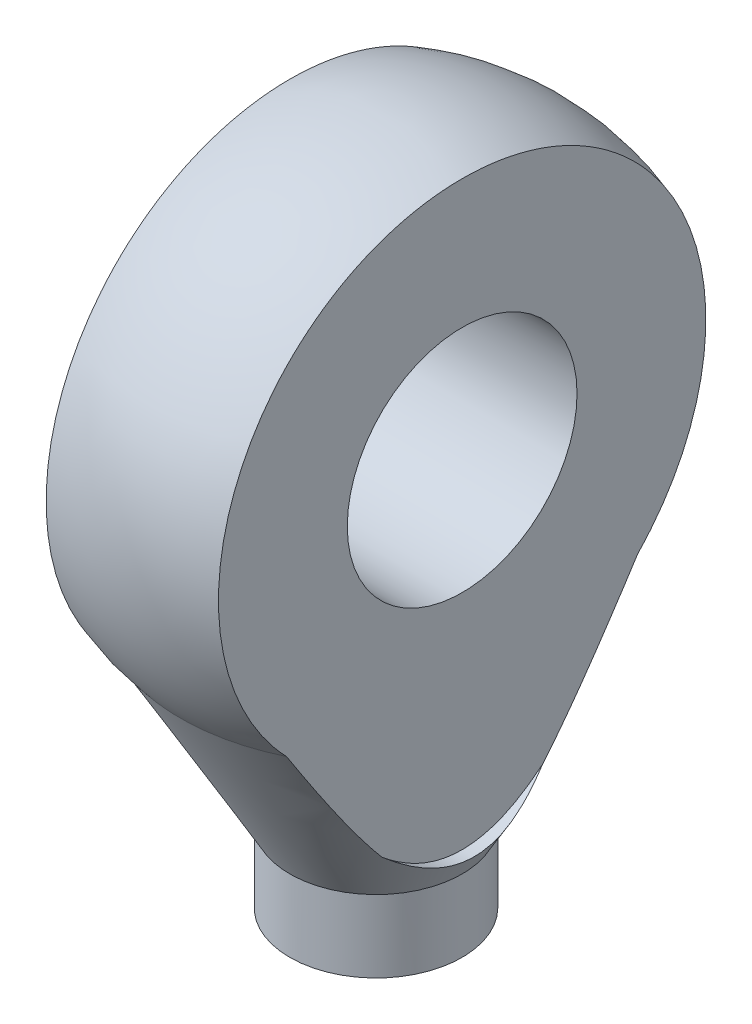
ISO-10303-21;
HEADER;
FILE_DESCRIPTION(('STEP AP214'),'2;1');
FILE_NAME('part.step','',(''),(''),'','','');
FILE_SCHEMA(('AUTOMOTIVE_DESIGN { 1 0 10303 214 1 1 1 1 }'));
ENDSEC;
DATA;
#1=APPLICATION_CONTEXT('core data for automotive mechanical design processes');
#2=APPLICATION_PROTOCOL_DEFINITION('international standard','automotive_design',2000,#1);
#3=PRODUCT_CONTEXT('',#1,'mechanical');
#4=PRODUCT('Part','Part','',(#3));
#5=PRODUCT_RELATED_PRODUCT_CATEGORY('part','',(#4));
#6=PRODUCT_DEFINITION_FORMATION('','',#4);
#7=PRODUCT_DEFINITION_CONTEXT('part definition',#1,'design');
#8=PRODUCT_DEFINITION('design','',#6,#7);
#9=PRODUCT_DEFINITION_SHAPE('','',#8);
#10=(LENGTH_UNIT() NAMED_UNIT(*) SI_UNIT(.MILLI.,.METRE.));
#11=(NAMED_UNIT(*) PLANE_ANGLE_UNIT() SI_UNIT($,.RADIAN.));
#12=(NAMED_UNIT(*) SI_UNIT($,.STERADIAN.) SOLID_ANGLE_UNIT());
#13=UNCERTAINTY_MEASURE_WITH_UNIT(LENGTH_MEASURE(1.E-05),#10,'distance_accuracy_value','');
#14=(GEOMETRIC_REPRESENTATION_CONTEXT(3) GLOBAL_UNCERTAINTY_ASSIGNED_CONTEXT((#13)) GLOBAL_UNIT_ASSIGNED_CONTEXT((#10,
#11,#12)) REPRESENTATION_CONTEXT('',''));
#15=CARTESIAN_POINT('',(0.,0.,0.));
#16=DIRECTION('',(0.,0.,1.));
#17=DIRECTION('',(1.,0.,0.));
#18=AXIS2_PLACEMENT_3D('',#15,#16,#17);
#19=CARTESIAN_POINT('',(0.,85.,0.));
#20=DIRECTION('',(0.,1.,0.));
#21=DIRECTION('',(1.,0.,0.));
#22=AXIS2_PLACEMENT_3D('',#19,#20,#21);
#23=SPHERICAL_SURFACE('',#22,9.00000000000001);
#24=CARTESIAN_POINT('',(3.,85.,0.));
#25=DIRECTION('',(-1.,0.,0.));
#26=DIRECTION('',(0.,0.,1.));
#27=AXIS2_PLACEMENT_3D('',#24,#25,#26);
#28=CIRCLE('',#27,8.48528137423857);
#29=CARTESIAN_POINT('',(3.,79.1171774114558,-6.11493241105034));
#30=VERTEX_POINT('',#29);
#31=CARTESIAN_POINT('',(3.,79.1171774114558,6.11493241105033));
#32=VERTEX_POINT('',#31);
#33=EDGE_CURVE('E81',#30,#32,#28,.F.);
#34=ORIENTED_EDGE('',*,*,#33,.F.);
#35=CARTESIAN_POINT('',(0.,79.1171774114558,0.));
#36=DIRECTION('',(0.,1.,0.));
#37=DIRECTION('',(-1.,0.,0.));
#38=AXIS2_PLACEMENT_3D('',#35,#36,#37);
#39=CIRCLE('',#38,6.81119654625484);
#40=CARTESIAN_POINT('',(-3.,79.1171774114558,-6.11493241105033));
#41=VERTEX_POINT('',#40);
#42=EDGE_CURVE('E98',#30,#41,#39,.T.);
#43=ORIENTED_EDGE('',*,*,#42,.T.);
#44=CARTESIAN_POINT('',(-3.,85.,0.));
#45=DIRECTION('',(1.,0.,0.));
#46=DIRECTION('',(0.,0.,-1.));
#47=AXIS2_PLACEMENT_3D('',#44,#45,#46);
#48=CIRCLE('',#47,8.48528137423857);
#49=CARTESIAN_POINT('',(-3.,79.1171774114558,6.11493241105034));
#50=VERTEX_POINT('',#49);
#51=EDGE_CURVE('E190',#50,#41,#48,.F.);
#52=ORIENTED_EDGE('',*,*,#51,.F.);
#53=EDGE_CURVE('E205',#50,#32,#39,.T.);
#54=ORIENTED_EDGE('',*,*,#53,.T.);
#55=EDGE_LOOP('',(#34,#43,#52,#54));
#56=FACE_BOUND('',#55,.T.);
#57=ADVANCED_FACE('F35',(#56),#23,.T.);
#58=CARTESIAN_POINT('',(0.,79.1171774114558,0.));
#59=DIRECTION('',(0.,1.,0.));
#60=DIRECTION('',(-1.,0.,0.));
#61=AXIS2_PLACEMENT_3D('',#58,#59,#60);
#62=CONICAL_SURFACE('',#61,6.81119654625484,0.5235987755983);
#63=CARTESIAN_POINT('',(3.,89.0277129654258,12.1687002182849));
#64=CARTESIAN_POINT('',(3.,88.434232047291,11.8157499478818));
#65=CARTESIAN_POINT('',(3.,87.8410989137341,11.4622109965145));
#66=CARTESIAN_POINT('',(3.,86.6557732662857,10.7533686630437));
#67=CARTESIAN_POINT('',(3.,86.0635808988087,10.3980650361904));
#68=CARTESIAN_POINT('',(3.,84.8778019608484,9.68354997630685));
#69=CARTESIAN_POINT('',(3.,84.2842217051544,9.32432805553628));
#70=CARTESIAN_POINT('',(3.,83.0990532287702,8.6027757178759));
#71=CARTESIAN_POINT('',(3.,82.5074647634746,8.24044570362898));
#72=CARTESIAN_POINT('',(3.,81.6184937554911,7.6912142996937));
#73=CARTESIAN_POINT('',(3.,81.3200572632117,7.50601921420721));
#74=CARTESIAN_POINT('',(3.,80.724096123733,7.13416838224396));
#75=CARTESIAN_POINT('',(3.,80.4265714737866,6.94751264017397));
#76=CARTESIAN_POINT('',(3.,79.832554106558,6.57230122932179));
#77=CARTESIAN_POINT('',(3.,79.5360618518418,6.38374482741821));
#78=CARTESIAN_POINT('',(3.,78.9445772011473,6.00430627463596));
#79=CARTESIAN_POINT('',(3.,78.6495847698979,5.81342417881238));
#80=CARTESIAN_POINT('',(3.,78.0622598733851,5.42906288453661));
#81=CARTESIAN_POINT('',(3.,77.7699228516894,5.23559066657521));
#82=CARTESIAN_POINT('',(3.,77.1879807413533,4.84459280960352));
#83=CARTESIAN_POINT('',(3.,76.8983755648414,4.64706730162326));
#84=CARTESIAN_POINT('',(3.,76.3232223103403,4.24652122906868));
#85=CARTESIAN_POINT('',(3.,76.0376718528191,4.0435041092881));
#86=CARTESIAN_POINT('',(3.,75.6138620000634,3.73286576400031));
#87=CARTESIAN_POINT('',(3.,75.4733566777263,3.62831020391827));
#88=CARTESIAN_POINT('',(3.,75.194269065799,3.41666704144714));
#89=CARTESIAN_POINT('',(3.,75.055686666919,3.30957958390227));
#90=CARTESIAN_POINT('',(3.,74.8707902866183,3.16327040881839));
#91=CARTESIAN_POINT('',(3.,74.8233732024426,3.12544036331517));
#92=CARTESIAN_POINT('',(3.,74.728871584163,3.04936468537097));
#93=CARTESIAN_POINT('',(3.,74.6817870587351,3.01111904215343));
#94=CARTESIAN_POINT('',(3.,74.5410781480917,2.89570208608246));
#95=CARTESIAN_POINT('',(3.,74.4480048630145,2.81785582178319));
#96=CARTESIAN_POINT('',(3.,74.2633610961785,2.65974724133996));
#97=CARTESIAN_POINT('',(3.,74.1717970408566,2.57947739965823));
#98=CARTESIAN_POINT('',(3.,73.9910056101773,2.41635099384583));
#99=CARTESIAN_POINT('',(3.,73.9017780660762,2.33349461746842));
#100=CARTESIAN_POINT('',(3.,73.7213588471127,2.15984324306072));
#101=CARTESIAN_POINT('',(3.,73.6303428755116,2.06886453738327));
#102=CARTESIAN_POINT('',(3.,73.4528003877012,1.88249940937518));
#103=CARTESIAN_POINT('',(3.,73.3662762045741,1.78711074414376));
#104=CARTESIAN_POINT('',(3.,73.1998721089525,1.59128618413));
#105=CARTESIAN_POINT('',(3.,73.1199675670819,1.4908714561862));
#106=CARTESIAN_POINT('',(3.,72.969234718366,1.28351192700059));
#107=CARTESIAN_POINT('',(3.,72.8983942844151,1.17657613957359));
#108=CARTESIAN_POINT('',(3.,72.7765609553431,0.96645130754558));
#109=CARTESIAN_POINT('',(3.,72.7242703443368,0.864028431115825));
#110=CARTESIAN_POINT('',(3.,72.6346279566756,0.652732100806545));
#111=CARTESIAN_POINT('',(3.,72.5972532607749,0.543868840871355));
#112=CARTESIAN_POINT('',(3.,72.5557730490834,0.376134130535145));
#113=CARTESIAN_POINT('',(3.,72.5443475838237,0.319041613266724));
#114=CARTESIAN_POINT('',(3.,72.5270521986943,0.20403332399558));
#115=CARTESIAN_POINT('',(3.,72.5211792974264,0.146118010762202));
#116=CARTESIAN_POINT('',(3.,72.5152790137246,0.0299914911495968));
#117=CARTESIAN_POINT('',(3.,72.5152510938561,-0.0282196875331749));
#118=CARTESIAN_POINT('',(3.,72.5210284954344,-0.144336961479267));
#119=CARTESIAN_POINT('',(3.,72.5268336550078,-0.202243065163875));
#120=CARTESIAN_POINT('',(3.,72.5502174372495,-0.358638552878509));
#121=CARTESIAN_POINT('',(3.,72.5732628430674,-0.456338339745938));
#122=CARTESIAN_POINT('',(3.,72.6330636261563,-0.647301530251787));
#123=CARTESIAN_POINT('',(3.,72.6698244690738,-0.740563148536991));
#124=CARTESIAN_POINT('',(3.,72.7515804328953,-0.917317207215446));
#125=CARTESIAN_POINT('',(3.,72.7960348012717,-1.00106543109796));
#126=CARTESIAN_POINT('',(3.,72.8920743192687,-1.16440859380664));
#127=CARTESIAN_POINT('',(3.,72.9436660803192,-1.24399958648427));
#128=CARTESIAN_POINT('',(3.,73.0524549384102,-1.39978566722155));
#129=CARTESIAN_POINT('',(3.,73.1096780294507,-1.47596239525543));
#130=CARTESIAN_POINT('',(3.,73.2281964991644,-1.62499472393054));
#131=CARTESIAN_POINT('',(3.,73.2894900167229,-1.69785181705784));
#132=CARTESIAN_POINT('',(3.,73.4128121056983,-1.8380083385662));
#133=CARTESIAN_POINT('',(3.,73.4747210064176,-1.90541373898393));
#134=CARTESIAN_POINT('',(3.,73.6008680013315,-2.03801479987932));
#135=CARTESIAN_POINT('',(3.,73.6651064074381,-2.10321016216308));
#136=CARTESIAN_POINT('',(3.,73.8606866164158,-2.29604275359615));
#137=CARTESIAN_POINT('',(3.,73.9948207335177,-2.4208460327615));
#138=CARTESIAN_POINT('',(3.,74.2683832762052,-2.66509747567564));
#139=CARTESIAN_POINT('',(3.,74.4078234904095,-2.78453225378121));
#140=CARTESIAN_POINT('',(3.,74.6902925209801,-3.01909976029142));
#141=CARTESIAN_POINT('',(3.,74.8333217908261,-3.13423194043842));
#142=CARTESIAN_POINT('',(3.,75.1232017985246,-3.36206864070738));
#143=CARTESIAN_POINT('',(3.,75.2700743246175,-3.47474530811474));
#144=CARTESIAN_POINT('',(3.,75.5658644386073,-3.69739679538848));
#145=CARTESIAN_POINT('',(3.,75.714782175558,-3.80737141668458));
#146=CARTESIAN_POINT('',(3.,76.0139566069063,-4.02495482493012));
#147=CARTESIAN_POINT('',(3.,76.1642106831252,-4.13256721989674));
#148=CARTESIAN_POINT('',(3.,76.4659757828991,-4.34600183579522));
#149=CARTESIAN_POINT('',(3.,76.6174867680731,-4.45182411109229));
#150=CARTESIAN_POINT('',(3.,77.0237486446238,-4.73265188833168));
#151=CARTESIAN_POINT('',(3.,77.2794159168286,-4.90633111554099));
#152=CARTESIAN_POINT('',(3.,77.792825862969,-5.25059867156008));
#153=CARTESIAN_POINT('',(3.,78.0505685936372,-5.42118691546077));
#154=CARTESIAN_POINT('',(3.,78.5676436732109,-5.75998735813301));
#155=CARTESIAN_POINT('',(3.,78.8269761691556,-5.92819933221717));
#156=CARTESIAN_POINT('',(3.,79.3468582066832,-6.26273339980386));
#157=CARTESIAN_POINT('',(3.,79.6074077573884,-6.42905547910873));
#158=CARTESIAN_POINT('',(3.,80.3910555904301,-6.92612513901494));
#159=CARTESIAN_POINT('',(3.,80.915589052725,-7.25460920510286));
#160=CARTESIAN_POINT('',(3.,81.9671332766999,-7.90750982691125));
#161=CARTESIAN_POINT('',(3.,82.4941439018356,-8.23192660329325));
#162=CARTESIAN_POINT('',(3.,83.5206707500642,-8.85997517248174));
#163=CARTESIAN_POINT('',(3.,84.0200919504452,-9.16376240686829));
#164=CARTESIAN_POINT('',(3.,85.0201076780668,-9.76941744177943));
#165=CARTESIAN_POINT('',(3.,85.5207022255603,-10.0712852088334));
#166=CARTESIAN_POINT('',(3.,86.5219807556379,-10.6730697781602));
#167=CARTESIAN_POINT('',(3.,87.0226633350382,-10.9729889166163));
#168=CARTESIAN_POINT('',(3.,88.0247156266938,-11.5716505637289));
#169=CARTESIAN_POINT('',(3.,88.5260853225151,-11.8703930998868));
#170=CARTESIAN_POINT('',(3.,89.0277129654258,-12.1687002182849));
#171=B_SPLINE_CURVE_WITH_KNOTS('',3,(#63,#64,#65,#66,#67,#68,#69,#70,#71,#72,#73,#74,#75,#76,
#77,#78,#79,#80,#81,#82,#83,#84,#85,#86,#87,#88,#89,#90,#91,#92,#93,#94,#95,#96,#97,#98,#99,
#100,#101,#102,#103,#104,#105,#106,#107,#108,#109,#110,#111,#112,#113,#114,#115,#116,#117,#118,
#119,#120,#121,#122,#123,#124,#125,#126,#127,#128,#129,#130,#131,#132,#133,#134,#135,#136,#137,
#138,#139,#140,#141,#142,#143,#144,#145,#146,#147,#148,#149,#150,#151,#152,#153,#154,#155,#156,
#157,#158,#159,#160,#161,#162,#163,#164,#165,#166,#167,#168,#169,#170),.UNSPECIFIED.,.F.,.F.,(4,
2,2,2,2,2,2,2,2,2,2,2,2,2,2,2,2,2,2,2,2,2,2,2,2,2,2,2,2,2,2,2,2,2,2,2,2,2,2,2,2,2,2,2,2,2,2,2,2,
2,2,2,2,4),(0.,2.07150978561835,4.14331538084288,6.22475142290165,8.30592177616018,
9.35960450625664,10.4132840586332,11.4673868982472,12.5214648328515,13.5731191803624,
14.6247395846099,15.6757149606134,16.2011115258245,16.7264781066457,16.9084526211638,
17.0904318656441,17.4544149359308,17.8196764181035,18.1849114477832,18.5708648295217,
18.9570167139181,19.3416604870048,19.7257841308175,20.0699752859968,20.4136355144558,
20.5880764974506,20.7624237626793,20.9367549970078,21.1110813936162,21.4108862712883,
21.7108107500145,21.9948126704685,22.2790794481796,22.5647261274918,22.8502430884742,
23.1247405190994,23.3992748406134,23.9486681764226,24.4993629288385,25.0501276157971,
25.6054346266943,26.1607823251405,26.7152126471424,27.2696261009816,28.1968311261058,
29.1240615829958,30.0513791347979,30.9787036483856,32.8353711110109,34.6919374046468,
36.4456059209534,38.1993049333743,39.9502203360893,41.7010945677724),.UNSPECIFIED.);
#172=CARTESIAN_POINT('',(3.00000000000001,74.4196522180206,2.79312647703188));
#173=VERTEX_POINT('',#172);
#174=EDGE_CURVE('E77',#32,#173,#171,.T.);
#175=ORIENTED_EDGE('',*,*,#174,.F.);
#176=ORIENTED_EDGE('',*,*,#53,.F.);
#177=CARTESIAN_POINT('',(-3.,89.0277560384104,-12.1687258310688));
#178=CARTESIAN_POINT('',(-3.,88.4342737998858,-11.8157748181514));
#179=CARTESIAN_POINT('',(-3.,87.8411393452726,-11.4622351253413));
#180=CARTESIAN_POINT('',(-3.,86.655811054519,-10.753391312506));
#181=CARTESIAN_POINT('',(-3.,86.0636173647911,-10.3980869477342));
#182=CARTESIAN_POINT('',(-3.,84.8778358026119,-9.68357043006131));
#183=CARTESIAN_POINT('',(-3.,84.2842542448709,-9.32434778954934));
#184=CARTESIAN_POINT('',(-3.,83.0990831597275,-8.60279401778763));
#185=CARTESIAN_POINT('',(-3.,82.5074933877232,-8.24046328917527));
#186=CARTESIAN_POINT('',(-3.,81.6185205178066,-7.69123088403873));
#187=CARTESIAN_POINT('',(-3.,81.3200834722554,-7.50603550901599));
#188=CARTESIAN_POINT('',(-3.,80.7241212235236,-7.13418410185813));
#189=CARTESIAN_POINT('',(-3.,80.4265960175958,-6.94752807412972));
#190=CARTESIAN_POINT('',(-3.,79.8325775360229,-6.57231609776945));
#191=CARTESIAN_POINT('',(-3.,79.5360847229366,-6.38375941602701));
#192=CARTESIAN_POINT('',(-3.,78.9445989504849,-6.00432031021664));
#193=CARTESIAN_POINT('',(-3.,78.6496059558487,-5.81343794120294));
#194=CARTESIAN_POINT('',(-3.,78.0622799194358,-5.42907610548068));
#195=CARTESIAN_POINT('',(-3.,77.7699423212926,-5.23560361916535));
#196=CARTESIAN_POINT('',(-3.,77.1879990476705,-4.84460523814611));
#197=CARTESIAN_POINT('',(-3.,76.8983932843215,-4.64707947447032));
#198=CARTESIAN_POINT('',(-3.,76.3232388383661,-4.2465329080166));
#199=CARTESIAN_POINT('',(-3.,76.0376877762661,-4.04351554997992));
#200=CARTESIAN_POINT('',(-3.,75.6138769952852,-3.7328768691377));
#201=CARTESIAN_POINT('',(-3.,75.4733713598575,-3.62832120073357));
#202=CARTESIAN_POINT('',(-3.,75.1942831120112,-3.41667783112717));
#203=CARTESIAN_POINT('',(-3.,75.0557003903047,-3.30959027476666));
#204=CARTESIAN_POINT('',(-3.,74.8708034000829,-3.16328084360759));
#205=CARTESIAN_POINT('',(-3.,74.8233860359099,-3.12545063406779));
#206=CARTESIAN_POINT('',(-3.,74.7288838582008,-3.04937462670332));
#207=CARTESIAN_POINT('',(-3.,74.6817990533405,-3.01112881810216));
#208=CARTESIAN_POINT('',(-3.,74.5410893053854,-2.89571136349466));
#209=CARTESIAN_POINT('',(-3.,74.4480154634578,-2.81786476368348));
#210=CARTESIAN_POINT('',(-3.,74.2633705836618,-2.65975550105092));
#211=CARTESIAN_POINT('',(-3.,74.1718059722762,-2.57948531262512));
#212=CARTESIAN_POINT('',(-3.,73.9910134364226,-2.41635820121366));
#213=CARTESIAN_POINT('',(-3.,73.9017853432073,-2.33350146598541));
#214=CARTESIAN_POINT('',(-3.,73.7213651323804,-2.15984945726707));
#215=CARTESIAN_POINT('',(-3.,73.6303487140913,-2.06887047991192));
#216=CARTESIAN_POINT('',(-3.,73.452805338906,-1.88250479307693));
#217=CARTESIAN_POINT('',(-3.,73.3662807151093,-1.7871158406752));
#218=CARTESIAN_POINT('',(-3.,73.1998757548834,-1.59129068561688));
#219=CARTESIAN_POINT('',(-3.,73.1199707889243,-1.4908756499763));
#220=CARTESIAN_POINT('',(-3.,72.9692371206303,-1.28351546985734));
#221=CARTESIAN_POINT('',(-3.,72.8983962910955,-1.17657933928567));
#222=CARTESIAN_POINT('',(-3.,72.7765624470179,-0.966454114268257));
#223=CARTESIAN_POINT('',(-3.,72.724271677941,-0.864031212549511));
#224=CARTESIAN_POINT('',(-3.,72.6346289563856,-0.652734816013351));
#225=CARTESIAN_POINT('',(-3.,72.5972540848555,-0.543871515088102));
#226=CARTESIAN_POINT('',(-3.,72.5557736059994,-0.376136717993239));
#227=CARTESIAN_POINT('',(-3.,72.5443480502825,-0.319044165681971));
#228=CARTESIAN_POINT('',(-3.,72.5270524883237,-0.204035797797916));
#229=CARTESIAN_POINT('',(-3.,72.5211795006703,-0.146120441000833));
#230=CARTESIAN_POINT('',(-3.,72.5152790526683,-0.0299938267689614));
#231=CARTESIAN_POINT('',(-3.,72.5152510547743,0.02821740296291));
#232=CARTESIAN_POINT('',(-3.,72.521028312437,0.144334785874696));
#233=CARTESIAN_POINT('',(-3.,72.5268334061123,0.202240947476107));
#234=CARTESIAN_POINT('',(-3.,72.5502170213224,0.358636545981177));
#235=CARTESIAN_POINT('',(-3.,72.5732623316436,0.456336391435761));
#236=CARTESIAN_POINT('',(-3.,72.6330629549837,0.647299704354069));
#237=CARTESIAN_POINT('',(-3.,72.6698237337813,0.740561386427215));
#238=CARTESIAN_POINT('',(-3.,72.7515795130524,0.917315381865707));
#239=CARTESIAN_POINT('',(-3.,72.7960337395705,1.00106348840098));
#240=CARTESIAN_POINT('',(-3.,72.8920729653838,1.16440642832545));
#241=CARTESIAN_POINT('',(-3.,72.9436645760816,1.24399731558933));
#242=CARTESIAN_POINT('',(-3.,73.0524531283529,1.39978319256828));
#243=CARTESIAN_POINT('',(-3.,73.1096760638538,1.47595982233618));
#244=CARTESIAN_POINT('',(-3.,73.2281942210339,1.62499196043371));
#245=CARTESIAN_POINT('',(-3.,73.2894875816058,1.69784896124146));
#246=CARTESIAN_POINT('',(-3.,73.4128092572761,1.83800518616389));
#247=CARTESIAN_POINT('',(-3.,73.4747178966216,1.90541038666289));
#248=CARTESIAN_POINT('',(-3.,73.6008643616808,2.03801105722609));
#249=CARTESIAN_POINT('',(-3.,73.6651024993045,2.10320622909875));
#250=CARTESIAN_POINT('',(-3.,73.8606818952851,2.29603825970857));
#251=CARTESIAN_POINT('',(-3.,73.9948154607641,2.4208411792539));
#252=CARTESIAN_POINT('',(-3.,74.2683768896979,2.66509191876891));
#253=CARTESIAN_POINT('',(-3.,74.4078165417401,2.78452635314735));
#254=CARTESIAN_POINT('',(-3.,74.6902844432444,3.01909318262033));
#255=CARTESIAN_POINT('',(-3.,74.8333131461861,3.13422502945808));
#256=CARTESIAN_POINT('',(-3.,75.1231920188387,3.36206107151324));
#257=CARTESIAN_POINT('',(-3.,75.2700639768778,3.47473741393267));
#258=CARTESIAN_POINT('',(-3.,75.5658529535919,3.69738825518873));
#259=CARTESIAN_POINT('',(-3.,75.7147701213204,3.80736255545595));
#260=CARTESIAN_POINT('',(-3.,76.0139434147841,4.02494532478665));
#261=CARTESIAN_POINT('',(-3.,76.1641969223425,4.13255740186175));
#262=CARTESIAN_POINT('',(-3.,76.46596088471,4.34599138351962));
#263=CARTESIAN_POINT('',(-3.,76.6174713011383,4.4518133424677));
#264=CARTESIAN_POINT('',(-3.,77.0237338558989,4.73264179525332));
#265=CARTESIAN_POINT('',(-3.,77.2794023997137,4.90632197966632));
#266=CARTESIAN_POINT('',(-3.,77.792814919977,5.25059140540468));
#267=CARTESIAN_POINT('',(-3.,78.0505589531604,5.42118056181743));
#268=CARTESIAN_POINT('',(-3.,78.5676366588953,5.75998279914889));
#269=CARTESIAN_POINT('',(-3.,78.8269704784909,5.92819565537243));
#270=CARTESIAN_POINT('',(-3.,79.346855177442,6.26273146549366));
#271=CARTESIAN_POINT('',(-3.,79.60740606592,6.42905440519328));
#272=CARTESIAN_POINT('',(-3.,80.3910579341883,6.92612662771382));
#273=CARTESIAN_POINT('',(-3.,80.9155941086884,7.25461237274563));
#274=CARTESIAN_POINT('',(-3.,81.9671437768233,7.90751631823577));
#275=CARTESIAN_POINT('',(-3.,82.4941571339095,8.23193473936259));
#276=CARTESIAN_POINT('',(-3.,83.5206889739402,8.85998628405355));
#277=CARTESIAN_POINT('',(-3.,84.0201124324764,9.16377485199276));
#278=CARTESIAN_POINT('',(-3.,85.0201326819595,9.76943254510737));
#279=CARTESIAN_POINT('',(-3.,85.5207294931601,10.0713016368112));
#280=CARTESIAN_POINT('',(-3.,86.5220125428199,10.6730888429893));
#281=CARTESIAN_POINT('',(-3.,87.0226973780765,10.9730092936783));
#282=CARTESIAN_POINT('',(-3.,88.0247541834247,11.5716735611994));
#283=CARTESIAN_POINT('',(-3.,88.5261261370819,11.8704174055336));
#284=CARTESIAN_POINT('',(-3.,89.0277560384104,12.1687258310689));
#285=B_SPLINE_CURVE_WITH_KNOTS('',3,(#177,#178,#179,#180,#181,#182,#183,#184,#185,#186,#187,
#188,#189,#190,#191,#192,#193,#194,#195,#196,#197,#198,#199,#200,#201,#202,#203,#204,#205,#206,
#207,#208,#209,#210,#211,#212,#213,#214,#215,#216,#217,#218,#219,#220,#221,#222,#223,#224,#225,
#226,#227,#228,#229,#230,#231,#232,#233,#234,#235,#236,#237,#238,#239,#240,#241,#242,#243,#244,
#245,#246,#247,#248,#249,#250,#251,#252,#253,#254,#255,#256,#257,#258,#259,#260,#261,#262,#263,
#264,#265,#266,#267,#268,#269,#270,#271,#272,#273,#274,#275,#276,#277,#278,#279,#280,#281,#282,
#283,#284),.UNSPECIFIED.,.F.,.F.,(4,2,2,2,2,2,2,2,2,2,2,2,2,2,2,2,2,2,2,2,2,2,2,2,2,2,2,2,2,2,2,
2,2,2,2,2,2,2,2,2,2,2,2,2,2,2,2,2,2,2,2,2,2,4),(0.,2.07151432880308,4.14332446447923,
6.22476496634114,8.30593978197319,9.3596243804242,10.4133058011789,11.4674105048543,
12.5214903038017,13.5731465379631,14.6247688291898,15.6757460986872,16.2011436116266,
16.7265111405182,16.9084866185632,17.0904668265472,17.4544518239936,17.8197152462449,
18.1849522154005,18.5709071211108,18.9570605314459,19.3417058183644,19.7258309715161,
20.0700224124117,20.4136829300308,20.5881240692064,20.7624714901832,20.9368028769624,
21.1111294257867,21.4109344048782,21.7108589876837,21.9948603988576,22.2791266660227,
22.5647728294617,22.8502892752676,23.1247857340851,23.3993190835272,23.9487104734615,
24.4994032742436,25.0501660093834,25.6054710746906,26.1608168272872,26.7152452070026,
27.2696567185681,28.1968665119561,29.1241017379228,30.0514240611478,30.9787533463204,
32.8354303778074,34.6920062374273,36.445682620598,38.1993895007151,39.9503127320578,
41.701194791452),.UNSPECIFIED.);
#286=CARTESIAN_POINT('',(-3.,74.41965468106,2.7931244832241));
#287=VERTEX_POINT('',#286);
#288=EDGE_CURVE('E188',#287,#50,#285,.T.);
#289=ORIENTED_EDGE('',*,*,#288,.F.);
#290=CARTESIAN_POINT('',(-3.,74.4192790096168,-2.79297030664519));
#291=CARTESIAN_POINT('',(-3.02439317343294,74.3481356839449,-2.70645602250348));
#292=CARTESIAN_POINT('',(-3.04837521829061,74.2786419297085,-2.61841294404528));
#293=CARTESIAN_POINT('',(-3.09540712839202,74.1432187857204,-2.43827843601746));
#294=CARTESIAN_POINT('',(-3.11844834877223,74.0773211227418,-2.34616096090742));
#295=CARTESIAN_POINT('',(-3.16316240566757,73.950309684511,-2.15796244216625));
#296=CARTESIAN_POINT('',(-3.18483138568511,73.8892092851151,-2.06187138262416));
#297=CARTESIAN_POINT('',(-3.22669834518542,73.7720600627313,-1.864055779825));
#298=CARTESIAN_POINT('',(-3.24686550944076,73.7161133078009,-1.76226372947803));
#299=CARTESIAN_POINT('',(-3.2848572802394,73.6119858337272,-1.55465386494234));
#300=CARTESIAN_POINT('',(-3.30268760809237,73.5637860793503,-1.44884673307941));
#301=CARTESIAN_POINT('',(-3.33534232282723,73.4763814945651,-1.23330545893348));
#302=CARTESIAN_POINT('',(-3.35017195009896,73.4371609669068,-1.12357856348245));
#303=CARTESIAN_POINT('',(-3.3731922017148,73.3765620293768,-0.925676968354581));
#304=CARTESIAN_POINT('',(-3.38212585052579,73.3531546750219,-0.838208994648996));
#305=CARTESIAN_POINT('',(-3.39750181093112,73.3130532027933,-0.661498803030849));
#306=CARTESIAN_POINT('',(-3.4039437032509,73.2963602146913,-0.572256289179761));
#307=CARTESIAN_POINT('',(-3.414045953537,73.2702311437185,-0.393200045162188));
#308=CARTESIAN_POINT('',(-3.41772566541122,73.260744561636,-0.303394821399612));
#309=CARTESIAN_POINT('',(-3.42222898278666,73.2491054350199,-0.123238371545295));
#310=CARTESIAN_POINT('',(-3.42305278418696,73.246952387448,-0.0328871833294897));
#311=CARTESIAN_POINT('',(-3.42186345562618,73.2501427304463,0.147936669518136));
#312=CARTESIAN_POINT('',(-3.41984165463753,73.2555090335173,0.238408862538559));
#313=CARTESIAN_POINT('',(-3.4129043639022,73.2734052411548,0.418525411046793));
#314=CARTESIAN_POINT('',(-3.40798880007721,73.285935329109,0.508169745282322));
#315=CARTESIAN_POINT('',(-3.39554504728233,73.3180332134235,0.686266415703885));
#316=CARTESIAN_POINT('',(-3.38800930633628,73.3376213587806,0.77471453011728));
#317=CARTESIAN_POINT('',(-3.37057228207245,73.3832781954814,0.949683163735511));
#318=CARTESIAN_POINT('',(-3.3606707629047,73.4093475329609,1.03620348981385));
#319=CARTESIAN_POINT('',(-3.34206289647822,73.4588075112634,1.18172302180349));
#320=CARTESIAN_POINT('',(-3.33386787770376,73.4807136028982,1.2413002560983));
#321=CARTESIAN_POINT('',(-3.31654127175499,73.5271812190986,1.35927436664292));
#322=CARTESIAN_POINT('',(-3.3074095897971,73.5517430124158,1.41767112271962));
#323=CARTESIAN_POINT('',(-3.27880442822619,73.6291577161089,1.59105323731189));
#324=CARTESIAN_POINT('',(-3.25812546574755,73.6857277664231,1.70419523584031));
#325=CARTESIAN_POINT('',(-3.21427394308556,73.807071601242,1.92562891948502));
#326=CARTESIAN_POINT('',(-3.19109779744476,73.8718572058907,2.03391330563449));
#327=CARTESIAN_POINT('',(-3.14283969185625,74.0080137862491,2.24574484538296));
#328=CARTESIAN_POINT('',(-3.11775830858496,74.0793827706952,2.34929341733315));
#329=CARTESIAN_POINT('',(-3.07704349660686,74.1962215166165,2.5092612578287));
#330=CARTESIAN_POINT('',(-3.06189099722535,74.2399070534755,2.56712403112803));
#331=CARTESIAN_POINT('',(-3.03121995651073,74.3286876147634,2.6812636683635));
#332=CARTESIAN_POINT('',(-3.01570316709403,74.373776138808,2.73754605375918));
#333=CARTESIAN_POINT('',(-3.00000000000002,74.4195563231677,2.7932052687538));
#334=B_SPLINE_CURVE_WITH_KNOTS('',3,(#290,#291,#292,#293,#294,#295,#296,#297,#298,#299,#300,
#301,#302,#303,#304,#305,#306,#307,#308,#309,#310,#311,#312,#313,#314,#315,#316,#317,#318,#319,
#320,#321,#322,#323,#324,#325,#326,#327,#328,#329,#330,#331,#332,#333),.UNSPECIFIED.,.F.,.F.,(4,
2,2,2,2,2,2,2,2,2,2,2,2,2,2,2,2,2,2,2,2,4),(0.,0.343945524371458,0.690551362610508,
1.03809161803248,1.39146842644718,1.74396321779484,2.09583699971362,2.36852595572555,
2.64126077571104,2.91206630042888,3.182853249073,3.45446711966604,3.72608794368832,
3.99849822381784,4.27093567250558,4.46287378464556,4.65483133874166,5.03885863538797,
5.42344485756082,5.80791513366597,6.03009392354696,6.25136339811549),.UNSPECIFIED.);
#335=CARTESIAN_POINT('',(-3.,74.4193982916796,-2.79287236754916));
#336=VERTEX_POINT('',#335);
#337=EDGE_CURVE('E43',#336,#287,#334,.T.);
#338=ORIENTED_EDGE('',*,*,#337,.F.);
#339=EDGE_CURVE('E200',#41,#336,#285,.T.);
#340=ORIENTED_EDGE('',*,*,#339,.F.);
#341=ORIENTED_EDGE('',*,*,#42,.F.);
#342=CARTESIAN_POINT('',(3.,74.4194001598478,-2.79287087160969));
#343=VERTEX_POINT('',#342);
#344=EDGE_CURVE('E96',#343,#30,#171,.T.);
#345=ORIENTED_EDGE('',*,*,#344,.F.);
#346=CARTESIAN_POINT('',(3.,74.4192790096167,-2.79297030664514));
#347=CARTESIAN_POINT('',(3.02439317343295,74.3481356839448,-2.70645602250344));
#348=CARTESIAN_POINT('',(3.04837521829061,74.2786419297085,-2.61841294404526));
#349=CARTESIAN_POINT('',(3.095407128392,74.1432187857204,-2.43827843601747));
#350=CARTESIAN_POINT('',(3.1184483487722,74.0773211227417,-2.34616096090745));
#351=CARTESIAN_POINT('',(3.16316240566755,73.9503096845111,-2.15796244216631));
#352=CARTESIAN_POINT('',(3.1848313856851,73.8892092851151,-2.06187138262423));
#353=CARTESIAN_POINT('',(3.2266983451854,73.7720600627314,-1.86405577982511));
#354=CARTESIAN_POINT('',(3.24686550944073,73.716113307801,-1.76226372947817));
#355=CARTESIAN_POINT('',(3.28485728023936,73.6119858337273,-1.55465386494252));
#356=CARTESIAN_POINT('',(3.30268760809234,73.5637860793504,-1.44884673307961));
#357=CARTESIAN_POINT('',(3.33534232282719,73.4763814945652,-1.23330545893372));
#358=CARTESIAN_POINT('',(3.3501719500989,73.4371609669069,-1.12357856348272));
#359=CARTESIAN_POINT('',(3.37319220171475,73.3765620293769,-0.925676968354864));
#360=CARTESIAN_POINT('',(3.38212585052576,73.353154675022,-0.838208994649273));
#361=CARTESIAN_POINT('',(3.3975018109311,73.3130532027934,-0.661498803031113));
#362=CARTESIAN_POINT('',(3.40394370325088,73.2963602146913,-0.572256289180019));
#363=CARTESIAN_POINT('',(3.41404595353698,73.2702311437185,-0.393200045162434));
#364=CARTESIAN_POINT('',(3.41772566541121,73.2607445616361,-0.303394821399851));
#365=CARTESIAN_POINT('',(3.42222898278665,73.2491054350199,-0.123238371545518));
#366=CARTESIAN_POINT('',(3.42305278418696,73.246952387448,-0.0328871833297044));
#367=CARTESIAN_POINT('',(3.42186345562618,73.2501427304463,0.147936669517939));
#368=CARTESIAN_POINT('',(3.41984165463752,73.2555090335172,0.238408862538372));
#369=CARTESIAN_POINT('',(3.4129043639022,73.2734052411547,0.418525411046625));
#370=CARTESIAN_POINT('',(3.40798880007721,73.285935329109,0.508169745282163));
#371=CARTESIAN_POINT('',(3.39554504728233,73.3180332134235,0.686266415703745));
#372=CARTESIAN_POINT('',(3.38800930633629,73.3376213587806,0.774714530117149));
#373=CARTESIAN_POINT('',(3.37057228207246,73.3832781954814,0.9496831637354));
#374=CARTESIAN_POINT('',(3.36067076290471,73.4093475329609,1.03620348981375));
#375=CARTESIAN_POINT('',(3.34206289647823,73.4588075112634,1.18172302180339));
#376=CARTESIAN_POINT('',(3.33386787770378,73.4807136028981,1.24130025609821));
#377=CARTESIAN_POINT('',(3.31654127175501,73.5271812190986,1.35927436664283));
#378=CARTESIAN_POINT('',(3.3074095897971,73.5517430124158,1.41767112271954));
#379=CARTESIAN_POINT('',(3.27880442822619,73.6291577161089,1.59105323731181));
#380=CARTESIAN_POINT('',(3.25812546574755,73.6857277664231,1.70419523584023));
#381=CARTESIAN_POINT('',(3.21427394308558,73.807071601242,1.92562891948495));
#382=CARTESIAN_POINT('',(3.1910977974448,73.8718572058907,2.03391330563442));
#383=CARTESIAN_POINT('',(3.14283969185626,74.0080137862491,2.2457448453829));
#384=CARTESIAN_POINT('',(3.11775830858494,74.0793827706952,2.34929341733309));
#385=CARTESIAN_POINT('',(3.07704349660685,74.1962215166165,2.50926125782865));
#386=CARTESIAN_POINT('',(3.06189099722536,74.2399070534755,2.56712403112798));
#387=CARTESIAN_POINT('',(3.03121995651075,74.3286876147633,2.68126366836346));
#388=CARTESIAN_POINT('',(3.01570316709405,74.3737761388079,2.73754605375914));
#389=CARTESIAN_POINT('',(3.00000000000001,74.4195563231676,2.79320526875375));
#390=B_SPLINE_CURVE_WITH_KNOTS('',3,(#346,#347,#348,#349,#350,#351,#352,#353,#354,#355,#356,
#357,#358,#359,#360,#361,#362,#363,#364,#365,#366,#367,#368,#369,#370,#371,#372,#373,#374,#375,
#376,#377,#378,#379,#380,#381,#382,#383,#384,#385,#386,#387,#388,#389),.UNSPECIFIED.,.F.,.F.,(4,
2,2,2,2,2,2,2,2,2,2,2,2,2,2,2,2,2,2,2,2,4),(0.,0.343945524371396,0.690551362610392,
1.03809161803229,1.39146842644693,1.74396321779453,2.09583699971324,2.3685259557252,
2.64126077571071,2.91206630042858,3.18285324907272,3.45446711966579,3.7260879436881,
3.99849822381764,4.27093567250541,4.46287378464539,4.6548313387415,5.03885863538781,
5.42344485756068,5.80791513366584,6.03009392354683,6.25136339811537),.UNSPECIFIED.);
#391=EDGE_CURVE('E11',#343,#173,#390,.T.);
#392=ORIENTED_EDGE('',*,*,#391,.T.);
#393=EDGE_LOOP('',(#175,#176,#289,#338,#340,#341,#345,#392));
#394=FACE_BOUND('',#393,.T.);
#395=CARTESIAN_POINT('',(0.,72.5159913557114,0.));
#396=DIRECTION('',(0.,1.,0.));
#397=DIRECTION('',(-1.,0.,0.));
#398=AXIS2_PLACEMENT_3D('',#395,#396,#397);
#399=CIRCLE('',#398,3.);
#400=CARTESIAN_POINT('',(-3.,72.5159913557114,0.));
#401=VERTEX_POINT('',#400);
#402=EDGE_CURVE('E202',#401,#401,#399,.T.);
#403=ORIENTED_EDGE('',*,*,#402,.T.);
#404=EDGE_LOOP('',(#403));
#405=FACE_BOUND('',#404,.T.);
#406=ADVANCED_FACE('F93',(#394,#405),#62,.T.);
#407=CARTESIAN_POINT('',(0.,82.5,0.));
#408=DIRECTION('',(0.,1.,0.));
#409=DIRECTION('',(-1.,0.,0.));
#410=AXIS2_PLACEMENT_3D('',#407,#408,#409);
#411=CYLINDRICAL_SURFACE('',#410,3.);
#412=CARTESIAN_POINT('',(0.,70.,0.));
#413=DIRECTION('',(0.,1.,0.));
#414=DIRECTION('',(0.,0.,1.));
#415=AXIS2_PLACEMENT_3D('',#412,#413,#414);
#416=CIRCLE('',#415,3.);
#417=CARTESIAN_POINT('',(0.,70.,3.));
#418=VERTEX_POINT('',#417);
#419=EDGE_CURVE('E38',#418,#418,#416,.F.);
#420=ORIENTED_EDGE('',*,*,#419,.F.);
#421=EDGE_LOOP('',(#420));
#422=FACE_BOUND('',#421,.T.);
#423=ORIENTED_EDGE('',*,*,#402,.F.);
#424=EDGE_LOOP('',(#423));
#425=FACE_BOUND('',#424,.T.);
#426=ADVANCED_FACE('F214',(#422,#425),#411,.T.);
#427=CARTESIAN_POINT('',(4.,85.,0.));
#428=DIRECTION('',(-1.,0.,0.));
#429=DIRECTION('',(0.,0.,1.));
#430=AXIS2_PLACEMENT_3D('',#427,#428,#429);
#431=CYLINDRICAL_SURFACE('',#430,4.);
#432=CARTESIAN_POINT('',(3.,85.,0.));
#433=DIRECTION('',(-1.,0.,0.));
#434=DIRECTION('',(0.,0.,1.));
#435=AXIS2_PLACEMENT_3D('',#432,#433,#434);
#436=CIRCLE('',#435,4.);
#437=CARTESIAN_POINT('',(3.,85.,4.));
#438=VERTEX_POINT('',#437);
#439=EDGE_CURVE('E90',#438,#438,#436,.F.);
#440=ORIENTED_EDGE('',*,*,#439,.T.);
#441=EDGE_LOOP('',(#440));
#442=FACE_BOUND('',#441,.T.);
#443=CARTESIAN_POINT('',(-3.,85.,0.));
#444=DIRECTION('',(1.,0.,0.));
#445=DIRECTION('',(0.,0.,-1.));
#446=AXIS2_PLACEMENT_3D('',#443,#444,#445);
#447=CIRCLE('',#446,4.);
#448=CARTESIAN_POINT('',(-3.,85.,-4.));
#449=VERTEX_POINT('',#448);
#450=EDGE_CURVE('E191',#449,#449,#447,.F.);
#451=ORIENTED_EDGE('',*,*,#450,.T.);
#452=EDGE_LOOP('',(#451));
#453=FACE_BOUND('',#452,.T.);
#454=ADVANCED_FACE('F166',(#442,#453),#431,.F.);
#455=CARTESIAN_POINT('',(-3.,73.2481419947364,0.0256787408366755));
#456=DIRECTION('',(1.,0.,0.));
#457=DIRECTION('',(0.,0.,-1.));
#458=AXIS2_PLACEMENT_3D('',#455,#456,#457);
#459=PLANE('',#458);
#460=ORIENTED_EDGE('',*,*,#339,.T.);
#461=CARTESIAN_POINT('',(-3.,74.4195564053356,2.79320536864622));
#462=CARTESIAN_POINT('',(-3.,74.2184135646967,2.54867393589918));
#463=CARTESIAN_POINT('',(-3.,74.0306930457862,2.29206016907717));
#464=CARTESIAN_POINT('',(-3.,73.7756637169149,1.87335885359845));
#465=CARTESIAN_POINT('',(-3.,73.691591374957,1.71933135514897));
#466=CARTESIAN_POINT('',(-3.,73.5411719165457,1.4007159959108));
#467=CARTESIAN_POINT('',(-3.,73.474497231925,1.2348609584254));
#468=CARTESIAN_POINT('',(-3.,73.3658555190949,0.89855389819307));
#469=CARTESIAN_POINT('',(-3.,73.3235355855274,0.727839454223087));
#470=CARTESIAN_POINT('',(-3.,73.2655183732905,0.380729476034361));
#471=CARTESIAN_POINT('',(-3.,73.2495268438352,0.202925795791167));
#472=CARTESIAN_POINT('',(-3.,73.245372296539,-0.328815369072193));
#473=CARTESIAN_POINT('',(-3.,73.2997848810344,-0.676664628053822));
#474=CARTESIAN_POINT('',(-3.,73.509032988835,-1.35654602222957));
#475=CARTESIAN_POINT('',(-3.,73.6584647199371,-1.67407631202466));
#476=CARTESIAN_POINT('',(-3.,74.0090564705472,-2.26242875240366));
#477=CARTESIAN_POINT('',(-3.,74.2071643955945,-2.53510121184456));
#478=CARTESIAN_POINT('',(-3.,74.4192791300783,-2.79297045309111));
#479=B_SPLINE_CURVE_WITH_KNOTS('',3,(#461,#462,#463,#464,#465,#466,#467,#468,#469,#470,#471,
#472,#473,#474,#475,#476,#477,#478),.UNSPECIFIED.,.F.,.F.,(4,2,2,2,2,2,2,2,4),
(0.315819861755381,0.371934765350574,0.403184765350574,0.434434765350574,0.465684765350574,
0.496934765350574,0.559434765350574,0.621934765350575,0.681114903595195),.UNSPECIFIED.);
#480=EDGE_CURVE('E60',#336,#287,#479,.F.);
#481=ORIENTED_EDGE('',*,*,#480,.T.);
#482=ORIENTED_EDGE('',*,*,#288,.T.);
#483=ORIENTED_EDGE('',*,*,#51,.T.);
#484=EDGE_LOOP('',(#460,#481,#482,#483));
#485=FACE_BOUND('',#484,.T.);
#486=ORIENTED_EDGE('',*,*,#450,.F.);
#487=EDGE_LOOP('',(#486));
#488=FACE_BOUND('',#487,.T.);
#489=ADVANCED_FACE('F144',(#485,#488),#459,.F.);
#490=CARTESIAN_POINT('',(-3.,78.4576060604536,-6.27069350521821));
#491=CARTESIAN_POINT('',(-3.,77.884005030919,-5.86015523813956));
#492=CARTESIAN_POINT('',(-3.,77.318273551039,-5.43982290142355));
#493=CARTESIAN_POINT('',(-3.,76.2155879961085,-4.56334322977076));
#494=CARTESIAN_POINT('',(-3.,75.6775492297479,-4.10638195360453));
#495=CARTESIAN_POINT('',(-3.,74.9223295718486,-3.36337402136041));
#496=CARTESIAN_POINT('',(-3.,74.6807346771991,-3.10680462953914));
#497=CARTESIAN_POINT('',(-3.,74.2294779795915,-2.56565132167546));
#498=CARTESIAN_POINT('',(-3.,74.0186218454835,-2.27848107444797));
#499=CARTESIAN_POINT('',(-3.,73.6584647199371,-1.67407631202466));
#500=CARTESIAN_POINT('',(-3.,73.509032988835,-1.35654602222957));
#501=CARTESIAN_POINT('',(-3.,73.2997848810344,-0.676664628053822));
#502=CARTESIAN_POINT('',(-3.,73.245372296539,-0.328815369072193));
#503=CARTESIAN_POINT('',(-3.,73.2495268438352,0.202925795791167));
#504=CARTESIAN_POINT('',(-3.,73.2655183732905,0.380729476034361));
#505=CARTESIAN_POINT('',(-3.,73.3235355855274,0.727839454223087));
#506=CARTESIAN_POINT('',(-3.,73.3658555190949,0.89855389819307));
#507=CARTESIAN_POINT('',(-3.,73.474497231925,1.2348609584254));
#508=CARTESIAN_POINT('',(-3.,73.5411719165457,1.4007159959108));
#509=CARTESIAN_POINT('',(-3.,73.691591374957,1.71933135514897));
#510=CARTESIAN_POINT('',(-3.,73.7756637169149,1.87335885359845));
#511=CARTESIAN_POINT('',(-3.,74.049331958941,2.32266111012025));
#512=CARTESIAN_POINT('',(-3.,74.2614431590617,2.60691258662856));
#513=CARTESIAN_POINT('',(-3.,74.7160049981698,3.14550592938762));
#514=CARTESIAN_POINT('',(-3.,74.9569855068807,3.39901510275895));
#515=CARTESIAN_POINT('',(-3.,75.7052843800107,4.13032064689761));
#516=CARTESIAN_POINT('',(-3.,76.2365259237371,4.58054778611084));
#517=CARTESIAN_POINT('',(-3.,77.3283106136834,5.44723470219464));
#518=CARTESIAN_POINT('',(-3.,77.8888900963835,5.86365260466308));
#519=CARTESIAN_POINT('',(-3.,78.4576062728927,6.27069372686197));
#520=B_SPLINE_CURVE_WITH_KNOTS('',3,(#490,#491,#492,#493,#494,#495,#496,#497,#498,#499,#500,
#501,#502,#503,#504,#505,#506,#507,#508,#509,#510,#511,#512,#513,#514,#515,#516,#517,#518,#519),
.UNSPECIFIED.,.F.,.F.,(4,2,2,2,2,2,2,2,2,2,2,2,2,2,4),(0.,0.125000000000001,0.250000000000001,
0.312500000000001,0.375000000000002,0.437500000000002,0.500000000000002,0.531250000000002,
0.562500000000002,0.593750000000003,0.625000000000003,0.687500000000002,0.750000000000001,0.875,
1.),.UNSPECIFIED.);
#521=DIRECTION('',(-1.,0.,0.));
#522=VECTOR('',#521,1.);
#523=SURFACE_OF_LINEAR_EXTRUSION('',#520,#522);
#524=ORIENTED_EDGE('',*,*,#337,.T.);
#525=ORIENTED_EDGE('',*,*,#480,.F.);
#526=EDGE_LOOP('',(#524,#525));
#527=FACE_BOUND('',#526,.T.);
#528=ADVANCED_FACE('F116',(#527),#523,.F.);
#529=CARTESIAN_POINT('',(3.,73.2481419947364,0.0256787408366755));
#530=DIRECTION('',(-1.,0.,0.));
#531=DIRECTION('',(0.,0.,-1.));
#532=AXIS2_PLACEMENT_3D('',#529,#530,#531);
#533=PLANE('',#532);
#534=ORIENTED_EDGE('',*,*,#174,.T.);
#535=CARTESIAN_POINT('',(3.,74.419279224655,-2.79297056806852));
#536=CARTESIAN_POINT('',(3.,74.2071644544821,-2.53510129289642));
#537=CARTESIAN_POINT('',(3.,74.0090564958898,-2.2624287949327));
#538=CARTESIAN_POINT('',(3.,73.6584647199371,-1.67407631202466));
#539=CARTESIAN_POINT('',(3.,73.509032988835,-1.35654602222957));
#540=CARTESIAN_POINT('',(3.,73.2997848810344,-0.676664628053822));
#541=CARTESIAN_POINT('',(3.,73.245372296539,-0.328815369072193));
#542=CARTESIAN_POINT('',(3.,73.2495268438352,0.202925795791167));
#543=CARTESIAN_POINT('',(3.,73.2655183732905,0.380729476034361));
#544=CARTESIAN_POINT('',(3.,73.3235355855274,0.727839454223087));
#545=CARTESIAN_POINT('',(3.,73.3658555190949,0.89855389819307));
#546=CARTESIAN_POINT('',(3.,73.474497231925,1.2348609584254));
#547=CARTESIAN_POINT('',(3.,73.5411719165457,1.4007159959108));
#548=CARTESIAN_POINT('',(3.,73.691591374957,1.71933135514897));
#549=CARTESIAN_POINT('',(3.,73.7756637169149,1.87335885359845));
#550=CARTESIAN_POINT('',(3.,74.0306930469118,2.29206017092516));
#551=CARTESIAN_POINT('',(3.,74.2184135672766,2.54867393942584));
#552=CARTESIAN_POINT('',(3.,74.4195564094821,2.79320537368713));
#553=B_SPLINE_CURVE_WITH_KNOTS('',3,(#535,#536,#537,#538,#539,#540,#541,#542,#543,#544,#545,
#546,#547,#548,#549,#550,#551,#552),.UNSPECIFIED.,.F.,.F.,(4,2,2,2,2,2,2,2,4),
(0.315819852959736,0.375000000000002,0.437500000000002,0.500000000000002,0.531250000000002,
0.562500000000002,0.593750000000003,0.625000000000003,0.68111490398079),.UNSPECIFIED.);
#554=EDGE_CURVE('E51',#343,#173,#553,.T.);
#555=ORIENTED_EDGE('',*,*,#554,.F.);
#556=ORIENTED_EDGE('',*,*,#344,.T.);
#557=ORIENTED_EDGE('',*,*,#33,.T.);
#558=EDGE_LOOP('',(#534,#555,#556,#557));
#559=FACE_BOUND('',#558,.T.);
#560=ORIENTED_EDGE('',*,*,#439,.F.);
#561=EDGE_LOOP('',(#560));
#562=FACE_BOUND('',#561,.T.);
#563=ADVANCED_FACE('F78',(#559,#562),#533,.F.);
#564=CARTESIAN_POINT('',(3.,78.4576060604536,-6.27069350521821));
#565=CARTESIAN_POINT('',(3.,77.884005030919,-5.86015523813956));
#566=CARTESIAN_POINT('',(3.,77.318273551039,-5.43982290142355));
#567=CARTESIAN_POINT('',(3.,76.2155879961085,-4.56334322977076));
#568=CARTESIAN_POINT('',(3.,75.6775492297479,-4.10638195360453));
#569=CARTESIAN_POINT('',(3.,74.9223295718486,-3.36337402136041));
#570=CARTESIAN_POINT('',(3.,74.6807346771991,-3.10680462953914));
#571=CARTESIAN_POINT('',(3.,74.2294779795915,-2.56565132167546));
#572=CARTESIAN_POINT('',(3.,74.0186218454835,-2.27848107444797));
#573=CARTESIAN_POINT('',(3.,73.6584647199371,-1.67407631202466));
#574=CARTESIAN_POINT('',(3.,73.509032988835,-1.35654602222957));
#575=CARTESIAN_POINT('',(3.,73.2997848810344,-0.676664628053822));
#576=CARTESIAN_POINT('',(3.,73.245372296539,-0.328815369072193));
#577=CARTESIAN_POINT('',(3.,73.2495268438352,0.202925795791167));
#578=CARTESIAN_POINT('',(3.,73.2655183732905,0.380729476034361));
#579=CARTESIAN_POINT('',(3.,73.3235355855274,0.727839454223087));
#580=CARTESIAN_POINT('',(3.,73.3658555190949,0.89855389819307));
#581=CARTESIAN_POINT('',(3.,73.474497231925,1.2348609584254));
#582=CARTESIAN_POINT('',(3.,73.5411719165457,1.4007159959108));
#583=CARTESIAN_POINT('',(3.,73.691591374957,1.71933135514897));
#584=CARTESIAN_POINT('',(3.,73.7756637169149,1.87335885359845));
#585=CARTESIAN_POINT('',(3.,74.049331958941,2.32266111012025));
#586=CARTESIAN_POINT('',(3.,74.2614431590617,2.60691258662856));
#587=CARTESIAN_POINT('',(3.,74.7160049981698,3.14550592938762));
#588=CARTESIAN_POINT('',(3.,74.9569855068807,3.39901510275895));
#589=CARTESIAN_POINT('',(3.,75.7052843800107,4.13032064689761));
#590=CARTESIAN_POINT('',(3.,76.2365259237371,4.58054778611084));
#591=CARTESIAN_POINT('',(3.,77.3283106136834,5.44723470219464));
#592=CARTESIAN_POINT('',(3.,77.8888900963835,5.86365260466308));
#593=CARTESIAN_POINT('',(3.,78.4576062728927,6.27069372686197));
#594=B_SPLINE_CURVE_WITH_KNOTS('',3,(#564,#565,#566,#567,#568,#569,#570,#571,#572,#573,#574,
#575,#576,#577,#578,#579,#580,#581,#582,#583,#584,#585,#586,#587,#588,#589,#590,#591,#592,#593),
.UNSPECIFIED.,.F.,.F.,(4,2,2,2,2,2,2,2,2,2,2,2,2,2,4),(0.,0.125000000000001,0.250000000000001,
0.312500000000001,0.375000000000002,0.437500000000002,0.500000000000002,0.531250000000002,
0.562500000000002,0.593750000000003,0.625000000000003,0.687500000000002,0.750000000000001,0.875,
1.),.UNSPECIFIED.);
#595=DIRECTION('',(1.,0.,0.));
#596=VECTOR('',#595,1.);
#597=SURFACE_OF_LINEAR_EXTRUSION('',#594,#596);
#598=ORIENTED_EDGE('',*,*,#554,.T.);
#599=ORIENTED_EDGE('',*,*,#391,.F.);
#600=EDGE_LOOP('',(#598,#599));
#601=FACE_BOUND('',#600,.T.);
#602=ADVANCED_FACE('F88',(#601),#597,.T.);
#603=CARTESIAN_POINT('',(0.,70.,0.));
#604=DIRECTION('',(0.,1.,0.));
#605=DIRECTION('',(0.,0.,1.));
#606=AXIS2_PLACEMENT_3D('',#603,#604,#605);
#607=PLANE('',#606);
#608=ORIENTED_EDGE('',*,*,#419,.T.);
#609=EDGE_LOOP('',(#608));
#610=FACE_BOUND('',#609,.T.);
#611=ADVANCED_FACE('F117',(#610),#607,.F.);
#612=CLOSED_SHELL('',(#57,#406,#426,#454,#489,#528,#563,#602,#611));
#613=MANIFOLD_SOLID_BREP('B2',#612);
#614=ADVANCED_BREP_SHAPE_REPRESENTATION('',(#18,#613),#14);
#615=SHAPE_DEFINITION_REPRESENTATION(#9,#614);
ENDSEC;
END-ISO-10303-21;
